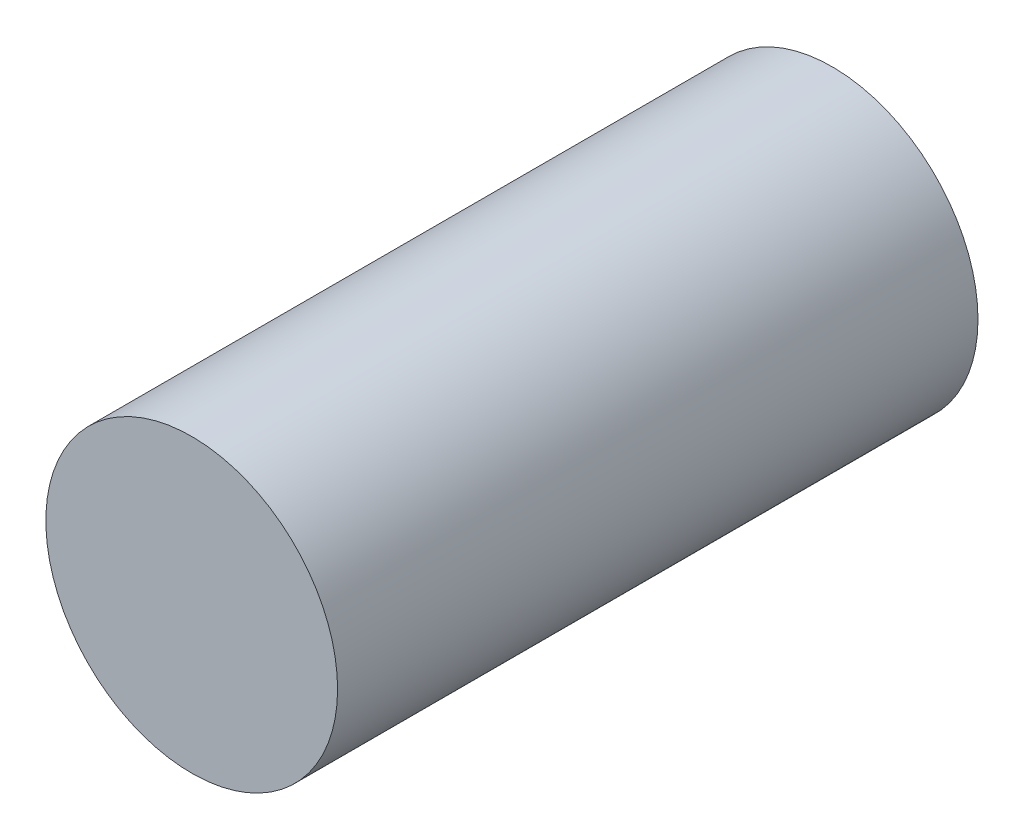
ISO-10303-21;
HEADER;
FILE_DESCRIPTION(('STEP AP214'),'2;1');
FILE_NAME('part.step','',(''),(''),'','','');
FILE_SCHEMA(('AUTOMOTIVE_DESIGN { 1 0 10303 214 1 1 1 1 }'));
ENDSEC;
DATA;
#1=APPLICATION_CONTEXT('core data for automotive mechanical design processes');
#2=APPLICATION_PROTOCOL_DEFINITION('international standard','automotive_design',2000,#1);
#3=PRODUCT_CONTEXT('',#1,'mechanical');
#4=PRODUCT('Part','Part','',(#3));
#5=PRODUCT_RELATED_PRODUCT_CATEGORY('part','',(#4));
#6=PRODUCT_DEFINITION_FORMATION('','',#4);
#7=PRODUCT_DEFINITION_CONTEXT('part definition',#1,'design');
#8=PRODUCT_DEFINITION('design','',#6,#7);
#9=PRODUCT_DEFINITION_SHAPE('','',#8);
#10=(LENGTH_UNIT() NAMED_UNIT(*) SI_UNIT(.MILLI.,.METRE.));
#11=(NAMED_UNIT(*) PLANE_ANGLE_UNIT() SI_UNIT($,.RADIAN.));
#12=(NAMED_UNIT(*) SI_UNIT($,.STERADIAN.) SOLID_ANGLE_UNIT());
#13=UNCERTAINTY_MEASURE_WITH_UNIT(LENGTH_MEASURE(1.E-05),#10,'distance_accuracy_value','');
#14=(GEOMETRIC_REPRESENTATION_CONTEXT(3) GLOBAL_UNCERTAINTY_ASSIGNED_CONTEXT((#13)) GLOBAL_UNIT_ASSIGNED_CONTEXT((#10,
#11,#12)) REPRESENTATION_CONTEXT('',''));
#15=CARTESIAN_POINT('',(0.,0.,0.));
#16=DIRECTION('',(0.,0.,1.));
#17=DIRECTION('',(1.,0.,0.));
#18=AXIS2_PLACEMENT_3D('',#15,#16,#17);
#19=CARTESIAN_POINT('',(10.16,1.27,0.1));
#20=DIRECTION('',(0.,0.,1.));
#21=DIRECTION('',(1.,0.,0.));
#22=AXIS2_PLACEMENT_3D('',#19,#20,#21);
#23=PLANE('',#22);
#24=CARTESIAN_POINT('',(10.16,1.27,0.1));
#25=DIRECTION('',(0.,0.,1.));
#26=DIRECTION('',(1.,0.,0.));
#27=AXIS2_PLACEMENT_3D('',#24,#25,#26);
#28=CIRCLE('',#27,0.41);
#29=CARTESIAN_POINT('',(10.57,1.27,0.1));
#30=VERTEX_POINT('',#29);
#31=EDGE_CURVE('E17',#30,#30,#28,.F.);
#32=ORIENTED_EDGE('',*,*,#31,.F.);
#33=EDGE_LOOP('',(#32));
#34=FACE_BOUND('',#33,.T.);
#35=ADVANCED_FACE('F14',(#34),#23,.T.);
#36=CARTESIAN_POINT('',(10.16,1.27,-1.7));
#37=DIRECTION('',(0.,0.,1.));
#38=DIRECTION('',(1.,0.,0.));
#39=AXIS2_PLACEMENT_3D('',#36,#37,#38);
#40=PLANE('',#39);
#41=CARTESIAN_POINT('',(10.16,1.27,-1.7));
#42=DIRECTION('',(0.,0.,1.));
#43=DIRECTION('',(1.,0.,0.));
#44=AXIS2_PLACEMENT_3D('',#41,#42,#43);
#45=CIRCLE('',#44,0.41);
#46=CARTESIAN_POINT('',(10.57,1.27,-1.7));
#47=VERTEX_POINT('',#46);
#48=EDGE_CURVE('E10',#47,#47,#45,.T.);
#49=ORIENTED_EDGE('',*,*,#48,.F.);
#50=EDGE_LOOP('',(#49));
#51=FACE_BOUND('',#50,.T.);
#52=ADVANCED_FACE('F29',(#51),#40,.F.);
#53=CARTESIAN_POINT('',(10.16,1.27,-1.7));
#54=DIRECTION('',(0.,0.,1.));
#55=DIRECTION('',(1.,0.,0.));
#56=AXIS2_PLACEMENT_3D('',#53,#54,#55);
#57=CYLINDRICAL_SURFACE('',#56,0.41);
#58=ORIENTED_EDGE('',*,*,#48,.T.);
#59=EDGE_LOOP('',(#58));
#60=FACE_BOUND('',#59,.T.);
#61=ORIENTED_EDGE('',*,*,#31,.T.);
#62=EDGE_LOOP('',(#61));
#63=FACE_BOUND('',#62,.T.);
#64=ADVANCED_FACE('F26',(#60,#63),#57,.T.);
#65=CLOSED_SHELL('',(#35,#52,#64));
#66=MANIFOLD_SOLID_BREP('B1',#65);
#67=ADVANCED_BREP_SHAPE_REPRESENTATION('',(#18,#66),#14);
#68=SHAPE_DEFINITION_REPRESENTATION(#9,#67);
ENDSEC;
END-ISO-10303-21;
